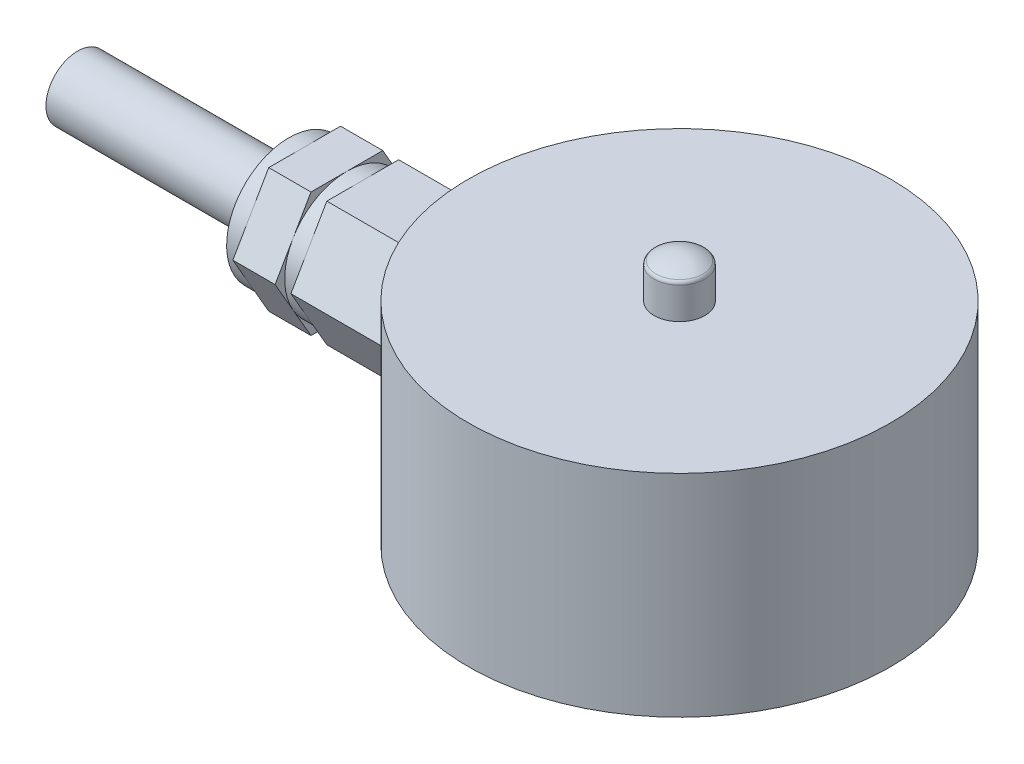
ISO-10303-21;
HEADER;
FILE_DESCRIPTION(('STEP AP214'),'2;1');
FILE_NAME('part.step','',(''),(''),'','','');
FILE_SCHEMA(('AUTOMOTIVE_DESIGN { 1 0 10303 214 1 1 1 1 }'));
ENDSEC;
DATA;
#1=APPLICATION_CONTEXT('core data for automotive mechanical design processes');
#2=APPLICATION_PROTOCOL_DEFINITION('international standard','automotive_design',2000,#1);
#3=PRODUCT_CONTEXT('',#1,'mechanical');
#4=PRODUCT('Part','Part','',(#3));
#5=PRODUCT_RELATED_PRODUCT_CATEGORY('part','',(#4));
#6=PRODUCT_DEFINITION_FORMATION('','',#4);
#7=PRODUCT_DEFINITION_CONTEXT('part definition',#1,'design');
#8=PRODUCT_DEFINITION('design','',#6,#7);
#9=PRODUCT_DEFINITION_SHAPE('','',#8);
#10=(LENGTH_UNIT() NAMED_UNIT(*) SI_UNIT(.MILLI.,.METRE.));
#11=(NAMED_UNIT(*) PLANE_ANGLE_UNIT() SI_UNIT($,.RADIAN.));
#12=(NAMED_UNIT(*) SI_UNIT($,.STERADIAN.) SOLID_ANGLE_UNIT());
#13=UNCERTAINTY_MEASURE_WITH_UNIT(LENGTH_MEASURE(1.E-05),#10,'distance_accuracy_value','');
#14=(GEOMETRIC_REPRESENTATION_CONTEXT(3) GLOBAL_UNCERTAINTY_ASSIGNED_CONTEXT((#13)) GLOBAL_UNIT_ASSIGNED_CONTEXT((#10,
#11,#12)) REPRESENTATION_CONTEXT('',''));
#15=CARTESIAN_POINT('',(0.,0.,0.));
#16=DIRECTION('',(0.,0.,1.));
#17=DIRECTION('',(1.,0.,0.));
#18=AXIS2_PLACEMENT_3D('',#15,#16,#17);
#19=CARTESIAN_POINT('',(-17.75,0.,0.));
#20=DIRECTION('',(-1.,0.,0.));
#21=DIRECTION('',(0.,0.,-1.));
#22=AXIS2_PLACEMENT_3D('',#19,#20,#21);
#23=PLANE('',#22);
#24=CARTESIAN_POINT('',(-17.75,4.5,0.));
#25=DIRECTION('',(1.,0.,0.));
#26=DIRECTION('',(0.,0.,-1.));
#27=AXIS2_PLACEMENT_3D('',#24,#25,#26);
#28=CIRCLE('',#27,2.94448637286709);
#29=CARTESIAN_POINT('',(-17.75,5.97224318643355,-2.55));
#30=VERTEX_POINT('',#29);
#31=CARTESIAN_POINT('',(-17.75,7.4444863728671,0.));
#32=VERTEX_POINT('',#31);
#33=EDGE_CURVE('E179',#30,#32,#28,.T.);
#34=ORIENTED_EDGE('',*,*,#33,.T.);
#35=DIRECTION('',(0.,0.,1.));
#36=VECTOR('',#35,1.);
#37=CARTESIAN_POINT('',(-17.75,7.4444863728671,-1.7));
#38=LINE('',#37,#36);
#39=CARTESIAN_POINT('',(-17.75,7.4444863728671,-1.7));
#40=VERTEX_POINT('',#39);
#41=EDGE_CURVE('E193',#40,#32,#38,.T.);
#42=ORIENTED_EDGE('',*,*,#41,.F.);
#43=DIRECTION('',(0.,0.866025403784439,0.5));
#44=VECTOR('',#43,1.);
#45=CARTESIAN_POINT('',(-17.75,4.5,-3.4));
#46=LINE('',#45,#44);
#47=EDGE_CURVE('E185',#30,#40,#46,.T.);
#48=ORIENTED_EDGE('',*,*,#47,.F.);
#49=EDGE_LOOP('',(#34,#42,#48));
#50=FACE_BOUND('',#49,.T.);
#51=ADVANCED_FACE('F17',(#50),#23,.T.);
#52=CARTESIAN_POINT('',(-17.75,5.97224318643356,2.55));
#53=VERTEX_POINT('',#52);
#54=EDGE_CURVE('E199',#32,#53,#28,.T.);
#55=ORIENTED_EDGE('',*,*,#54,.T.);
#56=DIRECTION('',(0.,-0.866025403784438,0.5));
#57=VECTOR('',#56,1.);
#58=CARTESIAN_POINT('',(-17.75,7.4444863728671,1.7));
#59=LINE('',#58,#57);
#60=CARTESIAN_POINT('',(-17.75,7.4444863728671,1.7));
#61=VERTEX_POINT('',#60);
#62=EDGE_CURVE('E980',#61,#53,#59,.T.);
#63=ORIENTED_EDGE('',*,*,#62,.F.);
#64=EDGE_CURVE('E188',#32,#61,#38,.T.);
#65=ORIENTED_EDGE('',*,*,#64,.F.);
#66=EDGE_LOOP('',(#55,#63,#65));
#67=FACE_BOUND('',#66,.T.);
#68=ADVANCED_FACE('F382',(#67),#23,.T.);
#69=CARTESIAN_POINT('',(-17.75,3.02775681356646,2.55));
#70=VERTEX_POINT('',#69);
#71=EDGE_CURVE('E209',#53,#70,#28,.T.);
#72=ORIENTED_EDGE('',*,*,#71,.T.);
#73=DIRECTION('',(0.,-0.866025403784439,-0.5));
#74=VECTOR('',#73,1.);
#75=CARTESIAN_POINT('',(-17.75,4.5,3.4));
#76=LINE('',#75,#74);
#77=CARTESIAN_POINT('',(-17.75,4.5,3.4));
#78=VERTEX_POINT('',#77);
#79=EDGE_CURVE('E234',#78,#70,#76,.T.);
#80=ORIENTED_EDGE('',*,*,#79,.F.);
#81=EDGE_CURVE('E977',#53,#78,#59,.T.);
#82=ORIENTED_EDGE('',*,*,#81,.F.);
#83=EDGE_LOOP('',(#72,#80,#82));
#84=FACE_BOUND('',#83,.T.);
#85=ADVANCED_FACE('F388',(#84),#23,.T.);
#86=CARTESIAN_POINT('',(-17.75,1.5555136271329,0.));
#87=VERTEX_POINT('',#86);
#88=EDGE_CURVE('E215',#70,#87,#28,.T.);
#89=ORIENTED_EDGE('',*,*,#88,.T.);
#90=DIRECTION('',(0.,0.,-1.));
#91=VECTOR('',#90,1.);
#92=CARTESIAN_POINT('',(-17.75,1.5555136271329,1.7));
#93=LINE('',#92,#91);
#94=CARTESIAN_POINT('',(-17.75,1.5555136271329,1.7));
#95=VERTEX_POINT('',#94);
#96=EDGE_CURVE('E227',#95,#87,#93,.T.);
#97=ORIENTED_EDGE('',*,*,#96,.F.);
#98=EDGE_CURVE('E982',#70,#95,#76,.T.);
#99=ORIENTED_EDGE('',*,*,#98,.F.);
#100=EDGE_LOOP('',(#89,#97,#99));
#101=FACE_BOUND('',#100,.T.);
#102=ADVANCED_FACE('F404',(#101),#23,.T.);
#103=CARTESIAN_POINT('',(-17.75,3.02775681356646,-2.55));
#104=VERTEX_POINT('',#103);
#105=EDGE_CURVE('E176',#87,#104,#28,.T.);
#106=ORIENTED_EDGE('',*,*,#105,.T.);
#107=DIRECTION('',(0.,0.866025403784439,-0.5));
#108=VECTOR('',#107,1.);
#109=CARTESIAN_POINT('',(-17.75,1.5555136271329,-1.7));
#110=LINE('',#109,#108);
#111=CARTESIAN_POINT('',(-17.75,1.5555136271329,-1.7));
#112=VERTEX_POINT('',#111);
#113=EDGE_CURVE('E223',#112,#104,#110,.T.);
#114=ORIENTED_EDGE('',*,*,#113,.F.);
#115=EDGE_CURVE('E40',#87,#112,#93,.T.);
#116=ORIENTED_EDGE('',*,*,#115,.F.);
#117=EDGE_LOOP('',(#106,#114,#116));
#118=FACE_BOUND('',#117,.T.);
#119=ADVANCED_FACE('F222',(#118),#23,.T.);
#120=CARTESIAN_POINT('',(-15.,0.,0.));
#121=DIRECTION('',(1.,0.,0.));
#122=DIRECTION('',(0.,0.,1.));
#123=AXIS2_PLACEMENT_3D('',#120,#121,#122);
#124=PLANE('',#123);
#125=CARTESIAN_POINT('',(-15.,4.5,0.));
#126=DIRECTION('',(1.,0.,0.));
#127=DIRECTION('',(0.,0.,-1.));
#128=AXIS2_PLACEMENT_3D('',#125,#126,#127);
#129=CIRCLE('',#128,2.94448637286709);
#130=CARTESIAN_POINT('',(-15.,5.97224318643355,-2.55));
#131=VERTEX_POINT('',#130);
#132=CARTESIAN_POINT('',(-15.,7.4444863728671,0.));
#133=VERTEX_POINT('',#132);
#134=EDGE_CURVE('E269',#131,#133,#129,.T.);
#135=ORIENTED_EDGE('',*,*,#134,.T.);
#136=DIRECTION('',(0.,0.,-1.));
#137=VECTOR('',#136,1.);
#138=CARTESIAN_POINT('',(-15.,7.4444863728671,1.7));
#139=LINE('',#138,#137);
#140=CARTESIAN_POINT('',(-15.,7.4444863728671,-1.7));
#141=VERTEX_POINT('',#140);
#142=EDGE_CURVE('E304',#133,#141,#139,.T.);
#143=ORIENTED_EDGE('',*,*,#142,.T.);
#144=DIRECTION('',(0.,-0.866025403784439,-0.5));
#145=VECTOR('',#144,1.);
#146=CARTESIAN_POINT('',(-15.,7.4444863728671,-1.7));
#147=LINE('',#146,#145);
#148=EDGE_CURVE('E308',#141,#131,#147,.T.);
#149=ORIENTED_EDGE('',*,*,#148,.T.);
#150=EDGE_LOOP('',(#135,#143,#149));
#151=FACE_BOUND('',#150,.T.);
#152=ADVANCED_FACE('F403',(#151),#124,.F.);
#153=CARTESIAN_POINT('',(-15.,5.97224318643355,2.55));
#154=VERTEX_POINT('',#153);
#155=EDGE_CURVE('E177',#133,#154,#129,.T.);
#156=ORIENTED_EDGE('',*,*,#155,.T.);
#157=DIRECTION('',(0.,0.866025403784439,-0.5));
#158=VECTOR('',#157,1.);
#159=CARTESIAN_POINT('',(-15.,4.5,3.4));
#160=LINE('',#159,#158);
#161=CARTESIAN_POINT('',(-15.,7.4444863728671,1.7));
#162=VERTEX_POINT('',#161);
#163=EDGE_CURVE('E301',#154,#162,#160,.T.);
#164=ORIENTED_EDGE('',*,*,#163,.T.);
#165=EDGE_CURVE('E305',#162,#133,#139,.T.);
#166=ORIENTED_EDGE('',*,*,#165,.T.);
#167=EDGE_LOOP('',(#156,#164,#166));
#168=FACE_BOUND('',#167,.T.);
#169=ADVANCED_FACE('F410',(#168),#124,.F.);
#170=CARTESIAN_POINT('',(-15.,3.02775681356646,2.55));
#171=VERTEX_POINT('',#170);
#172=EDGE_CURVE('E896',#154,#171,#129,.T.);
#173=ORIENTED_EDGE('',*,*,#172,.T.);
#174=DIRECTION('',(0.,0.866025403784439,0.5));
#175=VECTOR('',#174,1.);
#176=CARTESIAN_POINT('',(-15.,1.5555136271329,1.7));
#177=LINE('',#176,#175);
#178=CARTESIAN_POINT('',(-15.,4.5,3.4));
#179=VERTEX_POINT('',#178);
#180=EDGE_CURVE('E298',#171,#179,#177,.T.);
#181=ORIENTED_EDGE('',*,*,#180,.T.);
#182=EDGE_CURVE('E302',#179,#154,#160,.T.);
#183=ORIENTED_EDGE('',*,*,#182,.T.);
#184=EDGE_LOOP('',(#173,#181,#183));
#185=FACE_BOUND('',#184,.T.);
#186=ADVANCED_FACE('F457',(#185),#124,.F.);
#187=CARTESIAN_POINT('',(-15.,1.5555136271329,0.));
#188=VERTEX_POINT('',#187);
#189=EDGE_CURVE('E898',#171,#188,#129,.T.);
#190=ORIENTED_EDGE('',*,*,#189,.T.);
#191=DIRECTION('',(0.,0.,1.));
#192=VECTOR('',#191,1.);
#193=CARTESIAN_POINT('',(-15.,1.5555136271329,-1.7));
#194=LINE('',#193,#192);
#195=CARTESIAN_POINT('',(-15.,1.5555136271329,1.7));
#196=VERTEX_POINT('',#195);
#197=EDGE_CURVE('E273',#188,#196,#194,.T.);
#198=ORIENTED_EDGE('',*,*,#197,.T.);
#199=EDGE_CURVE('E299',#196,#171,#177,.T.);
#200=ORIENTED_EDGE('',*,*,#199,.T.);
#201=EDGE_LOOP('',(#190,#198,#200));
#202=FACE_BOUND('',#201,.T.);
#203=ADVANCED_FACE('F452',(#202),#124,.F.);
#204=CARTESIAN_POINT('',(-15.,3.02775681356646,-2.55));
#205=VERTEX_POINT('',#204);
#206=EDGE_CURVE('E901',#188,#205,#129,.T.);
#207=ORIENTED_EDGE('',*,*,#206,.T.);
#208=DIRECTION('',(0.,-0.866025403784439,0.5));
#209=VECTOR('',#208,1.);
#210=CARTESIAN_POINT('',(-15.,4.5,-3.4));
#211=LINE('',#210,#209);
#212=CARTESIAN_POINT('',(-15.,1.5555136271329,-1.7));
#213=VERTEX_POINT('',#212);
#214=EDGE_CURVE('E311',#205,#213,#211,.T.);
#215=ORIENTED_EDGE('',*,*,#214,.T.);
#216=EDGE_CURVE('E296',#213,#188,#194,.T.);
#217=ORIENTED_EDGE('',*,*,#216,.T.);
#218=EDGE_LOOP('',(#207,#215,#217));
#219=FACE_BOUND('',#218,.T.);
#220=ADVANCED_FACE('F448',(#219),#124,.F.);
#221=CARTESIAN_POINT('',(0.,10.,0.));
#222=DIRECTION('',(0.,-1.,0.));
#223=DIRECTION('',(0.,0.,1.));
#224=AXIS2_PLACEMENT_3D('',#221,#222,#223);
#225=CYLINDRICAL_SURFACE('',#224,10.);
#226=CARTESIAN_POINT('',(0.,0.,0.));
#227=DIRECTION('',(0.,-1.,0.));
#228=DIRECTION('',(0.,0.,-1.));
#229=AXIS2_PLACEMENT_3D('',#226,#227,#228);
#230=CIRCLE('',#229,10.);
#231=CARTESIAN_POINT('',(0.,0.,-10.));
#232=VERTEX_POINT('',#231);
#233=EDGE_CURVE('E348',#232,#232,#230,.T.);
#234=ORIENTED_EDGE('',*,*,#233,.F.);
#235=EDGE_LOOP('',(#234));
#236=FACE_BOUND('',#235,.T.);
#237=CARTESIAN_POINT('',(0.,10.,0.));
#238=DIRECTION('',(0.,-1.,0.));
#239=DIRECTION('',(0.,0.,-1.));
#240=AXIS2_PLACEMENT_3D('',#237,#238,#239);
#241=CIRCLE('',#240,10.);
#242=CARTESIAN_POINT('',(0.,10.,-10.));
#243=VERTEX_POINT('',#242);
#244=EDGE_CURVE('E349',#243,#243,#241,.T.);
#245=ORIENTED_EDGE('',*,*,#244,.T.);
#246=EDGE_LOOP('',(#245));
#247=FACE_BOUND('',#246,.T.);
#248=CARTESIAN_POINT('',(0.,-1.38897274573418,0.));
#249=DIRECTION('',(0.,-0.5,-0.866025403784439));
#250=DIRECTION('',(0.,-0.866025403784439,0.5));
#251=AXIS2_PLACEMENT_3D('',#248,#249,#250);
#252=ELLIPSE('',#251,20.,10.);
#253=CARTESIAN_POINT('',(-9.40425435640699,4.5,-3.4));
#254=VERTEX_POINT('',#253);
#255=CARTESIAN_POINT('',(-9.8544406233941,1.5555136271329,-1.7));
#256=VERTEX_POINT('',#255);
#257=EDGE_CURVE('E295',#254,#256,#252,.F.);
#258=ORIENTED_EDGE('',*,*,#257,.F.);
#259=CARTESIAN_POINT('',(0.,10.3889727457342,0.));
#260=DIRECTION('',(0.,0.5,-0.866025403784439));
#261=DIRECTION('',(0.,-0.866025403784439,-0.5));
#262=AXIS2_PLACEMENT_3D('',#259,#260,#261);
#263=ELLIPSE('',#262,20.,10.);
#264=CARTESIAN_POINT('',(-9.8544406233941,7.4444863728671,-1.7));
#265=VERTEX_POINT('',#264);
#266=EDGE_CURVE('E279',#265,#254,#263,.F.);
#267=ORIENTED_EDGE('',*,*,#266,.F.);
#268=CARTESIAN_POINT('',(0.,7.4444863728671,0.));
#269=DIRECTION('',(0.,1.,0.));
#270=DIRECTION('',(0.,0.,1.));
#271=AXIS2_PLACEMENT_3D('',#268,#269,#270);
#272=CIRCLE('',#271,10.);
#273=CARTESIAN_POINT('',(-9.8544406233941,7.4444863728671,1.7));
#274=VERTEX_POINT('',#273);
#275=EDGE_CURVE('E282',#274,#265,#272,.F.);
#276=ORIENTED_EDGE('',*,*,#275,.F.);
#277=CARTESIAN_POINT('',(0.,10.3889727457342,0.));
#278=DIRECTION('',(0.,0.5,0.866025403784439));
#279=DIRECTION('',(0.,-0.866025403784439,0.5));
#280=AXIS2_PLACEMENT_3D('',#277,#278,#279);
#281=ELLIPSE('',#280,20.,10.);
#282=CARTESIAN_POINT('',(-9.40425435640699,4.5,3.4));
#283=VERTEX_POINT('',#282);
#284=EDGE_CURVE('E286',#283,#274,#281,.F.);
#285=ORIENTED_EDGE('',*,*,#284,.F.);
#286=CARTESIAN_POINT('',(0.,-1.38897274573419,0.));
#287=DIRECTION('',(0.,-0.5,0.866025403784439));
#288=DIRECTION('',(0.,-0.866025403784439,-0.5));
#289=AXIS2_PLACEMENT_3D('',#286,#287,#288);
#290=ELLIPSE('',#289,20.,10.);
#291=CARTESIAN_POINT('',(-9.8544406233941,1.5555136271329,1.7));
#292=VERTEX_POINT('',#291);
#293=EDGE_CURVE('E289',#292,#283,#290,.F.);
#294=ORIENTED_EDGE('',*,*,#293,.F.);
#295=CARTESIAN_POINT('',(0.,1.5555136271329,0.));
#296=DIRECTION('',(0.,-1.,0.));
#297=DIRECTION('',(0.,0.,-1.));
#298=AXIS2_PLACEMENT_3D('',#295,#296,#297);
#299=CIRCLE('',#298,10.);
#300=EDGE_CURVE('E292',#256,#292,#299,.F.);
#301=ORIENTED_EDGE('',*,*,#300,.F.);
#302=EDGE_LOOP('',(#258,#267,#276,#285,#294,#301));
#303=FACE_BOUND('',#302,.T.);
#304=ADVANCED_FACE('F462',(#236,#247,#303),#225,.T.);
#305=CARTESIAN_POINT('',(0.,10.,0.));
#306=DIRECTION('',(0.,1.,0.));
#307=DIRECTION('',(0.,0.,-1.));
#308=AXIS2_PLACEMENT_3D('',#305,#306,#307);
#309=PLANE('',#308);
#310=CARTESIAN_POINT('',(0.,10.,0.));
#311=DIRECTION('',(0.,-1.,0.));
#312=DIRECTION('',(0.,0.,-1.));
#313=AXIS2_PLACEMENT_3D('',#310,#311,#312);
#314=CIRCLE('',#313,1.2);
#315=CARTESIAN_POINT('',(0.,10.,-1.2));
#316=VERTEX_POINT('',#315);
#317=EDGE_CURVE('E345',#316,#316,#314,.T.);
#318=ORIENTED_EDGE('',*,*,#317,.T.);
#319=EDGE_LOOP('',(#318));
#320=FACE_BOUND('',#319,.T.);
#321=ORIENTED_EDGE('',*,*,#244,.F.);
#322=EDGE_LOOP('',(#321));
#323=FACE_BOUND('',#322,.T.);
#324=ADVANCED_FACE('F467',(#320,#323),#309,.T.);
#325=CARTESIAN_POINT('',(0.,0.,0.));
#326=DIRECTION('',(0.,1.,0.));
#327=DIRECTION('',(0.,0.,-1.));
#328=AXIS2_PLACEMENT_3D('',#325,#326,#327);
#329=PLANE('',#328);
#330=CARTESIAN_POINT('',(0.,0.,0.));
#331=DIRECTION('',(0.,-1.,0.));
#332=DIRECTION('',(0.,0.,-1.));
#333=AXIS2_PLACEMENT_3D('',#330,#331,#332);
#334=CIRCLE('',#333,5.7);
#335=CARTESIAN_POINT('',(0.,0.,-5.7));
#336=VERTEX_POINT('',#335);
#337=EDGE_CURVE('E11',#336,#336,#334,.T.);
#338=ORIENTED_EDGE('',*,*,#337,.F.);
#339=EDGE_LOOP('',(#338));
#340=FACE_BOUND('',#339,.T.);
#341=CARTESIAN_POINT('',(-3.74999999999994,0.,-6.49519052838333));
#342=DIRECTION('',(0.,1.,0.));
#343=DIRECTION('',(0.,0.,1.));
#344=AXIS2_PLACEMENT_3D('',#341,#342,#343);
#345=CIRCLE('',#344,1.25);
#346=CARTESIAN_POINT('',(-3.74999999999994,0.,-5.24519052838333));
#347=VERTEX_POINT('',#346);
#348=EDGE_CURVE('E327',#347,#347,#345,.T.);
#349=ORIENTED_EDGE('',*,*,#348,.T.);
#350=EDGE_LOOP('',(#349));
#351=FACE_BOUND('',#350,.T.);
#352=CARTESIAN_POINT('',(-3.75,0.,6.49519052838327));
#353=DIRECTION('',(0.,1.,0.));
#354=DIRECTION('',(0.,0.,1.));
#355=AXIS2_PLACEMENT_3D('',#352,#353,#354);
#356=CIRCLE('',#355,1.25);
#357=CARTESIAN_POINT('',(-3.75,0.,7.74519052838327));
#358=VERTEX_POINT('',#357);
#359=EDGE_CURVE('E333',#358,#358,#356,.T.);
#360=ORIENTED_EDGE('',*,*,#359,.T.);
#361=EDGE_LOOP('',(#360));
#362=FACE_BOUND('',#361,.T.);
#363=CARTESIAN_POINT('',(7.5,0.,0.));
#364=DIRECTION('',(0.,1.,0.));
#365=DIRECTION('',(0.,0.,1.));
#366=AXIS2_PLACEMENT_3D('',#363,#364,#365);
#367=CIRCLE('',#366,1.25);
#368=CARTESIAN_POINT('',(7.5,0.,1.25));
#369=VERTEX_POINT('',#368);
#370=EDGE_CURVE('E339',#369,#369,#367,.T.);
#371=ORIENTED_EDGE('',*,*,#370,.T.);
#372=EDGE_LOOP('',(#371));
#373=FACE_BOUND('',#372,.T.);
#374=ORIENTED_EDGE('',*,*,#233,.T.);
#375=EDGE_LOOP('',(#374));
#376=FACE_BOUND('',#375,.T.);
#377=ADVANCED_FACE('F724',(#340,#351,#362,#373,#376),#329,.F.);
#378=CARTESIAN_POINT('',(0.,11.6,0.));
#379=DIRECTION('',(0.,-1.,0.));
#380=DIRECTION('',(0.,0.,1.));
#381=AXIS2_PLACEMENT_3D('',#378,#379,#380);
#382=CYLINDRICAL_SURFACE('',#381,1.2);
#383=CARTESIAN_POINT('',(0.,11.4966629547096,0.));
#384=DIRECTION('',(0.,1.,0.));
#385=DIRECTION('',(0.,0.,1.));
#386=AXIS2_PLACEMENT_3D('',#383,#384,#385);
#387=CIRCLE('',#386,1.2);
#388=CARTESIAN_POINT('',(0.,11.4966629547096,1.2));
#389=VERTEX_POINT('',#388);
#390=EDGE_CURVE('E357',#389,#389,#387,.T.);
#391=ORIENTED_EDGE('',*,*,#390,.F.);
#392=EDGE_LOOP('',(#391));
#393=FACE_BOUND('',#392,.T.);
#394=ORIENTED_EDGE('',*,*,#317,.F.);
#395=EDGE_LOOP('',(#394));
#396=FACE_BOUND('',#395,.T.);
#397=ADVANCED_FACE('F716',(#393,#396),#382,.T.);
#398=CARTESIAN_POINT('',(0.,10.,0.));
#399=DIRECTION('',(0.,0.,-1.));
#400=DIRECTION('',(1.,0.,0.));
#401=AXIS2_PLACEMENT_3D('',#398,#399,#400);
#402=SPHERICAL_SURFACE('',#401,2.);
#403=CARTESIAN_POINT('',(0.,10.,0.));
#404=DIRECTION('',(0.,1.,0.));
#405=DIRECTION('',(0.,0.,1.));
#406=AXIS2_PLACEMENT_3D('',#403,#404,#405);
#407=SPHERICAL_SURFACE('',#406,2.);
#408=CARTESIAN_POINT('',(0.,11.6629588385662,0.));
#409=DIRECTION('',(0.,1.,0.));
#410=DIRECTION('',(0.,0.,1.));
#411=AXIS2_PLACEMENT_3D('',#408,#409,#410);
#412=CIRCLE('',#411,1.11111111111111);
#413=CARTESIAN_POINT('',(0.,11.6629588385662,1.11111111111111));
#414=VERTEX_POINT('',#413);
#415=EDGE_CURVE('E352',#414,#414,#412,.F.);
#416=ORIENTED_EDGE('',*,*,#415,.F.);
#417=EDGE_LOOP('',(#416));
#418=FACE_BOUND('',#417,.T.);
#419=ADVANCED_FACE('F709',(#418),#407,.T.);
#420=CARTESIAN_POINT('',(0.,11.4966629547096,0.));
#421=DIRECTION('',(0.,-1.,0.));
#422=DIRECTION('',(0.,0.,1.));
#423=AXIS2_PLACEMENT_3D('',#420,#421,#422);
#424=TOROIDAL_SURFACE('',#423,1.,0.2);
#425=ORIENTED_EDGE('',*,*,#390,.T.);
#426=EDGE_LOOP('',(#425));
#427=FACE_BOUND('',#426,.T.);
#428=ORIENTED_EDGE('',*,*,#415,.T.);
#429=EDGE_LOOP('',(#428));
#430=FACE_BOUND('',#429,.T.);
#431=ADVANCED_FACE('F701',(#427,#430),#424,.T.);
#432=CARTESIAN_POINT('',(7.5,7.5,0.));
#433=DIRECTION('',(0.,-1.,0.));
#434=DIRECTION('',(0.,0.,1.));
#435=AXIS2_PLACEMENT_3D('',#432,#433,#434);
#436=CONICAL_SURFACE('',#435,1.25,1.02974425867665);
#437=CARTESIAN_POINT('',(7.5,8.25107577378445,0.));
#438=VERTEX_POINT('',#437);
#439=VERTEX_LOOP('',#438);
#440=FACE_BOUND('',#439,.T.);
#441=CARTESIAN_POINT('',(7.5,7.5,0.));
#442=DIRECTION('',(0.,1.,0.));
#443=DIRECTION('',(0.,0.,1.));
#444=AXIS2_PLACEMENT_3D('',#441,#442,#443);
#445=CIRCLE('',#444,1.25);
#446=CARTESIAN_POINT('',(7.5,7.5,1.25));
#447=VERTEX_POINT('',#446);
#448=EDGE_CURVE('E342',#447,#447,#445,.T.);
#449=ORIENTED_EDGE('',*,*,#448,.F.);
#450=EDGE_LOOP('',(#449));
#451=FACE_BOUND('',#450,.T.);
#452=ADVANCED_FACE('F691',(#440,#451),#436,.F.);
#453=CARTESIAN_POINT('',(7.5,0.,0.));
#454=DIRECTION('',(0.,-1.,0.));
#455=DIRECTION('',(0.,0.,1.));
#456=AXIS2_PLACEMENT_3D('',#453,#454,#455);
#457=CYLINDRICAL_SURFACE('',#456,1.25);
#458=ORIENTED_EDGE('',*,*,#448,.T.);
#459=EDGE_LOOP('',(#458));
#460=FACE_BOUND('',#459,.T.);
#461=ORIENTED_EDGE('',*,*,#370,.F.);
#462=EDGE_LOOP('',(#461));
#463=FACE_BOUND('',#462,.T.);
#464=ADVANCED_FACE('F683',(#460,#463),#457,.F.);
#465=CARTESIAN_POINT('',(-3.75,7.5,6.49519052838327));
#466=DIRECTION('',(0.,-1.,0.));
#467=DIRECTION('',(0.,0.,1.));
#468=AXIS2_PLACEMENT_3D('',#465,#466,#467);
#469=CONICAL_SURFACE('',#468,1.25,1.02974425867665);
#470=CARTESIAN_POINT('',(-3.75,8.25107577378445,6.49519052838327));
#471=VERTEX_POINT('',#470);
#472=VERTEX_LOOP('',#471);
#473=FACE_BOUND('',#472,.T.);
#474=CARTESIAN_POINT('',(-3.75,7.5,6.49519052838327));
#475=DIRECTION('',(0.,1.,0.));
#476=DIRECTION('',(0.,0.,1.));
#477=AXIS2_PLACEMENT_3D('',#474,#475,#476);
#478=CIRCLE('',#477,1.25);
#479=CARTESIAN_POINT('',(-3.75,7.5,7.74519052838327));
#480=VERTEX_POINT('',#479);
#481=EDGE_CURVE('E336',#480,#480,#478,.T.);
#482=ORIENTED_EDGE('',*,*,#481,.F.);
#483=EDGE_LOOP('',(#482));
#484=FACE_BOUND('',#483,.T.);
#485=ADVANCED_FACE('F673',(#473,#484),#469,.F.);
#486=CARTESIAN_POINT('',(-3.75,0.,6.49519052838327));
#487=DIRECTION('',(0.,-1.,0.));
#488=DIRECTION('',(0.,0.,1.));
#489=AXIS2_PLACEMENT_3D('',#486,#487,#488);
#490=CYLINDRICAL_SURFACE('',#489,1.25);
#491=ORIENTED_EDGE('',*,*,#481,.T.);
#492=EDGE_LOOP('',(#491));
#493=FACE_BOUND('',#492,.T.);
#494=ORIENTED_EDGE('',*,*,#359,.F.);
#495=EDGE_LOOP('',(#494));
#496=FACE_BOUND('',#495,.T.);
#497=ADVANCED_FACE('F664',(#493,#496),#490,.F.);
#498=CARTESIAN_POINT('',(-3.74999999999994,7.5,-6.49519052838333));
#499=DIRECTION('',(0.,-1.,0.));
#500=DIRECTION('',(0.,0.,1.));
#501=AXIS2_PLACEMENT_3D('',#498,#499,#500);
#502=CONICAL_SURFACE('',#501,1.25,1.02974425867665);
#503=CARTESIAN_POINT('',(-3.74999999999994,8.25107577378445,-6.49519052838333));
#504=VERTEX_POINT('',#503);
#505=VERTEX_LOOP('',#504);
#506=FACE_BOUND('',#505,.T.);
#507=CARTESIAN_POINT('',(-3.74999999999994,7.5,-6.49519052838333));
#508=DIRECTION('',(0.,1.,0.));
#509=DIRECTION('',(0.,0.,1.));
#510=AXIS2_PLACEMENT_3D('',#507,#508,#509);
#511=CIRCLE('',#510,1.25);
#512=CARTESIAN_POINT('',(-3.74999999999994,7.5,-5.24519052838333));
#513=VERTEX_POINT('',#512);
#514=EDGE_CURVE('E330',#513,#513,#511,.T.);
#515=ORIENTED_EDGE('',*,*,#514,.F.);
#516=EDGE_LOOP('',(#515));
#517=FACE_BOUND('',#516,.T.);
#518=ADVANCED_FACE('F652',(#506,#517),#502,.F.);
#519=CARTESIAN_POINT('',(-3.74999999999994,0.,-6.49519052838333));
#520=DIRECTION('',(0.,-1.,0.));
#521=DIRECTION('',(0.,0.,1.));
#522=AXIS2_PLACEMENT_3D('',#519,#520,#521);
#523=CYLINDRICAL_SURFACE('',#522,1.25);
#524=ORIENTED_EDGE('',*,*,#514,.T.);
#525=EDGE_LOOP('',(#524));
#526=FACE_BOUND('',#525,.T.);
#527=ORIENTED_EDGE('',*,*,#348,.F.);
#528=EDGE_LOOP('',(#527));
#529=FACE_BOUND('',#528,.T.);
#530=ADVANCED_FACE('F446',(#526,#529),#523,.F.);
#531=EDGE_CURVE('E278',#205,#131,#129,.T.);
#532=ORIENTED_EDGE('',*,*,#531,.T.);
#533=CARTESIAN_POINT('',(-15.,4.5,-3.4));
#534=VERTEX_POINT('',#533);
#535=EDGE_CURVE('E307',#131,#534,#147,.T.);
#536=ORIENTED_EDGE('',*,*,#535,.T.);
#537=EDGE_CURVE('E312',#534,#205,#211,.T.);
#538=ORIENTED_EDGE('',*,*,#537,.T.);
#539=EDGE_LOOP('',(#532,#536,#538));
#540=FACE_BOUND('',#539,.T.);
#541=ADVANCED_FACE('F413',(#540),#124,.F.);
#542=CARTESIAN_POINT('',(10.001,4.5,-3.4));
#543=DIRECTION('',(0.,0.5,0.866025403784439));
#544=DIRECTION('',(0.,0.866025403784439,-0.5));
#545=AXIS2_PLACEMENT_3D('',#542,#543,#544);
#546=PLANE('',#545);
#547=ORIENTED_EDGE('',*,*,#257,.T.);
#548=DIRECTION('',(-1.,0.,0.));
#549=VECTOR('',#548,1.);
#550=CARTESIAN_POINT('',(10.001,1.5555136271329,-1.7));
#551=LINE('',#550,#549);
#552=EDGE_CURVE('E314',#256,#213,#551,.T.);
#553=ORIENTED_EDGE('',*,*,#552,.T.);
#554=ORIENTED_EDGE('',*,*,#214,.F.);
#555=ORIENTED_EDGE('',*,*,#537,.F.);
#556=DIRECTION('',(-1.,0.,0.));
#557=VECTOR('',#556,1.);
#558=CARTESIAN_POINT('',(10.001,4.5,-3.4));
#559=LINE('',#558,#557);
#560=EDGE_CURVE('E316',#254,#534,#559,.T.);
#561=ORIENTED_EDGE('',*,*,#560,.F.);
#562=EDGE_LOOP('',(#547,#553,#554,#555,#561));
#563=FACE_BOUND('',#562,.T.);
#564=ADVANCED_FACE('F445',(#563),#546,.F.);
#565=CARTESIAN_POINT('',(10.001,7.4444863728671,-1.7));
#566=DIRECTION('',(0.,-0.5,0.866025403784439));
#567=DIRECTION('',(0.,0.866025403784439,0.5));
#568=AXIS2_PLACEMENT_3D('',#565,#566,#567);
#569=PLANE('',#568);
#570=ORIENTED_EDGE('',*,*,#266,.T.);
#571=ORIENTED_EDGE('',*,*,#560,.T.);
#572=ORIENTED_EDGE('',*,*,#535,.F.);
#573=ORIENTED_EDGE('',*,*,#148,.F.);
#574=DIRECTION('',(-1.,0.,0.));
#575=VECTOR('',#574,1.);
#576=CARTESIAN_POINT('',(10.001,7.4444863728671,-1.7));
#577=LINE('',#576,#575);
#578=EDGE_CURVE('E318',#265,#141,#577,.T.);
#579=ORIENTED_EDGE('',*,*,#578,.F.);
#580=EDGE_LOOP('',(#570,#571,#572,#573,#579));
#581=FACE_BOUND('',#580,.T.);
#582=ADVANCED_FACE('F631',(#581),#569,.F.);
#583=CARTESIAN_POINT('',(10.001,7.4444863728671,1.7));
#584=DIRECTION('',(0.,-1.,0.));
#585=DIRECTION('',(0.,0.,1.));
#586=AXIS2_PLACEMENT_3D('',#583,#584,#585);
#587=PLANE('',#586);
#588=ORIENTED_EDGE('',*,*,#275,.T.);
#589=ORIENTED_EDGE('',*,*,#578,.T.);
#590=ORIENTED_EDGE('',*,*,#142,.F.);
#591=ORIENTED_EDGE('',*,*,#165,.F.);
#592=DIRECTION('',(-1.,0.,0.));
#593=VECTOR('',#592,1.);
#594=CARTESIAN_POINT('',(10.001,7.4444863728671,1.7));
#595=LINE('',#594,#593);
#596=EDGE_CURVE('E320',#274,#162,#595,.T.);
#597=ORIENTED_EDGE('',*,*,#596,.F.);
#598=EDGE_LOOP('',(#588,#589,#590,#591,#597));
#599=FACE_BOUND('',#598,.T.);
#600=ADVANCED_FACE('F623',(#599),#587,.F.);
#601=CARTESIAN_POINT('',(10.001,4.5,3.4));
#602=DIRECTION('',(0.,-0.5,-0.866025403784439));
#603=DIRECTION('',(0.,-0.866025403784439,0.5));
#604=AXIS2_PLACEMENT_3D('',#601,#602,#603);
#605=PLANE('',#604);
#606=ORIENTED_EDGE('',*,*,#284,.T.);
#607=ORIENTED_EDGE('',*,*,#596,.T.);
#608=ORIENTED_EDGE('',*,*,#163,.F.);
#609=ORIENTED_EDGE('',*,*,#182,.F.);
#610=DIRECTION('',(-1.,0.,0.));
#611=VECTOR('',#610,1.);
#612=CARTESIAN_POINT('',(10.001,4.5,3.4));
#613=LINE('',#612,#611);
#614=EDGE_CURVE('E322',#283,#179,#613,.T.);
#615=ORIENTED_EDGE('',*,*,#614,.F.);
#616=EDGE_LOOP('',(#606,#607,#608,#609,#615));
#617=FACE_BOUND('',#616,.T.);
#618=ADVANCED_FACE('F615',(#617),#605,.F.);
#619=CARTESIAN_POINT('',(10.001,1.5555136271329,1.7));
#620=DIRECTION('',(0.,0.5,-0.866025403784439));
#621=DIRECTION('',(0.,-0.866025403784439,-0.5));
#622=AXIS2_PLACEMENT_3D('',#619,#620,#621);
#623=PLANE('',#622);
#624=ORIENTED_EDGE('',*,*,#293,.T.);
#625=ORIENTED_EDGE('',*,*,#614,.T.);
#626=ORIENTED_EDGE('',*,*,#180,.F.);
#627=ORIENTED_EDGE('',*,*,#199,.F.);
#628=DIRECTION('',(-1.,0.,0.));
#629=VECTOR('',#628,1.);
#630=CARTESIAN_POINT('',(10.001,1.5555136271329,1.7));
#631=LINE('',#630,#629);
#632=EDGE_CURVE('E283',#292,#196,#631,.T.);
#633=ORIENTED_EDGE('',*,*,#632,.F.);
#634=EDGE_LOOP('',(#624,#625,#626,#627,#633));
#635=FACE_BOUND('',#634,.T.);
#636=ADVANCED_FACE('F607',(#635),#623,.F.);
#637=CARTESIAN_POINT('',(10.001,1.5555136271329,-1.7));
#638=DIRECTION('',(0.,1.,0.));
#639=DIRECTION('',(0.,0.,-1.));
#640=AXIS2_PLACEMENT_3D('',#637,#638,#639);
#641=PLANE('',#640);
#642=ORIENTED_EDGE('',*,*,#300,.T.);
#643=ORIENTED_EDGE('',*,*,#632,.T.);
#644=ORIENTED_EDGE('',*,*,#197,.F.);
#645=ORIENTED_EDGE('',*,*,#216,.F.);
#646=ORIENTED_EDGE('',*,*,#552,.F.);
#647=EDGE_LOOP('',(#642,#643,#644,#645,#646));
#648=FACE_BOUND('',#647,.T.);
#649=ADVANCED_FACE('F599',(#648),#641,.F.);
#650=CARTESIAN_POINT('',(-15.75,4.5,0.));
#651=DIRECTION('',(1.,0.,0.));
#652=DIRECTION('',(0.,0.,1.));
#653=AXIS2_PLACEMENT_3D('',#650,#651,#652);
#654=CYLINDRICAL_SURFACE('',#653,2.94448637286709);
#655=CARTESIAN_POINT('',(-15.75,4.5,0.));
#656=DIRECTION('',(1.,0.,0.));
#657=DIRECTION('',(0.,0.,-1.));
#658=AXIS2_PLACEMENT_3D('',#655,#656,#657);
#659=CIRCLE('',#658,2.94448637286709);
#660=CARTESIAN_POINT('',(-15.75,5.97224318643355,-2.55));
#661=VERTEX_POINT('',#660);
#662=CARTESIAN_POINT('',(-15.75,7.4444863728671,0.));
#663=VERTEX_POINT('',#662);
#664=EDGE_CURVE('E270',#661,#663,#659,.T.);
#665=ORIENTED_EDGE('',*,*,#664,.T.);
#666=CARTESIAN_POINT('',(-15.75,5.97224318643355,2.55));
#667=VERTEX_POINT('',#666);
#668=EDGE_CURVE('E274',#663,#667,#659,.T.);
#669=ORIENTED_EDGE('',*,*,#668,.T.);
#670=CARTESIAN_POINT('',(-15.75,3.02775681356646,2.55));
#671=VERTEX_POINT('',#670);
#672=EDGE_CURVE('E967',#667,#671,#659,.T.);
#673=ORIENTED_EDGE('',*,*,#672,.T.);
#674=CARTESIAN_POINT('',(-15.75,1.5555136271329,0.));
#675=VERTEX_POINT('',#674);
#676=EDGE_CURVE('E968',#671,#675,#659,.T.);
#677=ORIENTED_EDGE('',*,*,#676,.T.);
#678=CARTESIAN_POINT('',(-15.75,3.02775681356645,-2.55));
#679=VERTEX_POINT('',#678);
#680=EDGE_CURVE('E970',#675,#679,#659,.T.);
#681=ORIENTED_EDGE('',*,*,#680,.T.);
#682=EDGE_CURVE('E275',#679,#661,#659,.T.);
#683=ORIENTED_EDGE('',*,*,#682,.T.);
#684=EDGE_LOOP('',(#665,#669,#673,#677,#681,#683));
#685=FACE_BOUND('',#684,.T.);
#686=ORIENTED_EDGE('',*,*,#134,.F.);
#687=ORIENTED_EDGE('',*,*,#531,.F.);
#688=ORIENTED_EDGE('',*,*,#206,.F.);
#689=ORIENTED_EDGE('',*,*,#189,.F.);
#690=ORIENTED_EDGE('',*,*,#172,.F.);
#691=ORIENTED_EDGE('',*,*,#155,.F.);
#692=EDGE_LOOP('',(#686,#687,#688,#689,#690,#691));
#693=FACE_BOUND('',#692,.T.);
#694=ADVANCED_FACE('F592',(#685,#693),#654,.T.);
#695=CARTESIAN_POINT('',(-15.75,0.,0.));
#696=DIRECTION('',(-1.,0.,0.));
#697=DIRECTION('',(0.,0.,-1.));
#698=AXIS2_PLACEMENT_3D('',#695,#696,#697);
#699=PLANE('',#698);
#700=DIRECTION('',(0.,0.866025403784439,0.5));
#701=VECTOR('',#700,1.);
#702=CARTESIAN_POINT('',(-15.75,4.5,-3.4));
#703=LINE('',#702,#701);
#704=CARTESIAN_POINT('',(-15.75,7.4444863728671,-1.7));
#705=VERTEX_POINT('',#704);
#706=EDGE_CURVE('E203',#661,#705,#703,.T.);
#707=ORIENTED_EDGE('',*,*,#706,.T.);
#708=DIRECTION('',(0.,0.,1.));
#709=VECTOR('',#708,1.);
#710=CARTESIAN_POINT('',(-15.75,7.4444863728671,-1.7));
#711=LINE('',#710,#709);
#712=EDGE_CURVE('E241',#705,#663,#711,.T.);
#713=ORIENTED_EDGE('',*,*,#712,.T.);
#714=ORIENTED_EDGE('',*,*,#664,.F.);
#715=EDGE_LOOP('',(#707,#713,#714));
#716=FACE_BOUND('',#715,.T.);
#717=ADVANCED_FACE('F559',(#716),#699,.F.);
#718=CARTESIAN_POINT('',(-15.75,7.4444863728671,1.7));
#719=VERTEX_POINT('',#718);
#720=EDGE_CURVE('E240',#663,#719,#711,.T.);
#721=ORIENTED_EDGE('',*,*,#720,.T.);
#722=DIRECTION('',(0.,-0.866025403784438,0.5));
#723=VECTOR('',#722,1.);
#724=CARTESIAN_POINT('',(-15.75,7.4444863728671,1.7));
#725=LINE('',#724,#723);
#726=EDGE_CURVE('E245',#719,#667,#725,.T.);
#727=ORIENTED_EDGE('',*,*,#726,.T.);
#728=ORIENTED_EDGE('',*,*,#668,.F.);
#729=EDGE_LOOP('',(#721,#727,#728));
#730=FACE_BOUND('',#729,.T.);
#731=ADVANCED_FACE('F579',(#730),#699,.F.);
#732=CARTESIAN_POINT('',(-15.75,4.5,3.4));
#733=VERTEX_POINT('',#732);
#734=EDGE_CURVE('E244',#667,#733,#725,.T.);
#735=ORIENTED_EDGE('',*,*,#734,.T.);
#736=DIRECTION('',(0.,-0.866025403784439,-0.5));
#737=VECTOR('',#736,1.);
#738=CARTESIAN_POINT('',(-15.75,4.5,3.4));
#739=LINE('',#738,#737);
#740=EDGE_CURVE('E249',#733,#671,#739,.T.);
#741=ORIENTED_EDGE('',*,*,#740,.T.);
#742=ORIENTED_EDGE('',*,*,#672,.F.);
#743=EDGE_LOOP('',(#735,#741,#742));
#744=FACE_BOUND('',#743,.T.);
#745=ADVANCED_FACE('F572',(#744),#699,.F.);
#746=CARTESIAN_POINT('',(-15.75,1.5555136271329,1.7));
#747=VERTEX_POINT('',#746);
#748=EDGE_CURVE('E248',#671,#747,#739,.T.);
#749=ORIENTED_EDGE('',*,*,#748,.T.);
#750=DIRECTION('',(0.,0.,-1.));
#751=VECTOR('',#750,1.);
#752=CARTESIAN_POINT('',(-15.75,1.5555136271329,1.7));
#753=LINE('',#752,#751);
#754=EDGE_CURVE('E253',#747,#675,#753,.T.);
#755=ORIENTED_EDGE('',*,*,#754,.T.);
#756=ORIENTED_EDGE('',*,*,#676,.F.);
#757=EDGE_LOOP('',(#749,#755,#756));
#758=FACE_BOUND('',#757,.T.);
#759=ADVANCED_FACE('F565',(#758),#699,.F.);
#760=CARTESIAN_POINT('',(-15.75,1.5555136271329,-1.7));
#761=VERTEX_POINT('',#760);
#762=EDGE_CURVE('E252',#675,#761,#753,.T.);
#763=ORIENTED_EDGE('',*,*,#762,.T.);
#764=DIRECTION('',(0.,0.866025403784439,-0.5));
#765=VECTOR('',#764,1.);
#766=CARTESIAN_POINT('',(-15.75,1.5555136271329,-1.7));
#767=LINE('',#766,#765);
#768=EDGE_CURVE('E194',#761,#679,#767,.T.);
#769=ORIENTED_EDGE('',*,*,#768,.T.);
#770=ORIENTED_EDGE('',*,*,#680,.F.);
#771=EDGE_LOOP('',(#763,#769,#770));
#772=FACE_BOUND('',#771,.T.);
#773=ADVANCED_FACE('F557',(#772),#699,.F.);
#774=CARTESIAN_POINT('',(-15.75,4.5,-3.4));
#775=VERTEX_POINT('',#774);
#776=EDGE_CURVE('E256',#679,#775,#767,.T.);
#777=ORIENTED_EDGE('',*,*,#776,.T.);
#778=EDGE_CURVE('E238',#775,#661,#703,.T.);
#779=ORIENTED_EDGE('',*,*,#778,.T.);
#780=ORIENTED_EDGE('',*,*,#682,.F.);
#781=EDGE_LOOP('',(#777,#779,#780));
#782=FACE_BOUND('',#781,.T.);
#783=ADVANCED_FACE('F550',(#782),#699,.F.);
#784=CARTESIAN_POINT('',(-17.75,4.5,-3.4));
#785=DIRECTION('',(0.,-0.5,0.866025403784439));
#786=DIRECTION('',(0.,0.866025403784439,0.5));
#787=AXIS2_PLACEMENT_3D('',#784,#785,#786);
#788=PLANE('',#787);
#789=ORIENTED_EDGE('',*,*,#778,.F.);
#790=DIRECTION('',(1.,0.,0.));
#791=VECTOR('',#790,1.);
#792=CARTESIAN_POINT('',(-17.75,4.5,-3.4));
#793=LINE('',#792,#791);
#794=CARTESIAN_POINT('',(-17.75,4.5,-3.4));
#795=VERTEX_POINT('',#794);
#796=EDGE_CURVE('E187',#795,#775,#793,.T.);
#797=ORIENTED_EDGE('',*,*,#796,.F.);
#798=EDGE_CURVE('E172',#795,#30,#46,.T.);
#799=ORIENTED_EDGE('',*,*,#798,.T.);
#800=ORIENTED_EDGE('',*,*,#47,.T.);
#801=DIRECTION('',(1.,0.,0.));
#802=VECTOR('',#801,1.);
#803=CARTESIAN_POINT('',(-17.75,7.4444863728671,-1.7));
#804=LINE('',#803,#802);
#805=EDGE_CURVE('E267',#40,#705,#804,.T.);
#806=ORIENTED_EDGE('',*,*,#805,.T.);
#807=ORIENTED_EDGE('',*,*,#706,.F.);
#808=EDGE_LOOP('',(#789,#797,#799,#800,#806,#807));
#809=FACE_BOUND('',#808,.T.);
#810=ADVANCED_FACE('F184',(#809),#788,.F.);
#811=CARTESIAN_POINT('',(-17.75,7.4444863728671,-1.7));
#812=DIRECTION('',(0.,-1.,0.));
#813=DIRECTION('',(0.,0.,1.));
#814=AXIS2_PLACEMENT_3D('',#811,#812,#813);
#815=PLANE('',#814);
#816=ORIENTED_EDGE('',*,*,#712,.F.);
#817=ORIENTED_EDGE('',*,*,#805,.F.);
#818=ORIENTED_EDGE('',*,*,#41,.T.);
#819=ORIENTED_EDGE('',*,*,#64,.T.);
#820=DIRECTION('',(1.,0.,0.));
#821=VECTOR('',#820,1.);
#822=CARTESIAN_POINT('',(-17.75,7.4444863728671,1.7));
#823=LINE('',#822,#821);
#824=EDGE_CURVE('E265',#61,#719,#823,.T.);
#825=ORIENTED_EDGE('',*,*,#824,.T.);
#826=ORIENTED_EDGE('',*,*,#720,.F.);
#827=EDGE_LOOP('',(#816,#817,#818,#819,#825,#826));
#828=FACE_BOUND('',#827,.T.);
#829=ADVANCED_FACE('F535',(#828),#815,.F.);
#830=CARTESIAN_POINT('',(-17.75,7.4444863728671,1.7));
#831=DIRECTION('',(0.,-0.5,-0.866025403784438));
#832=DIRECTION('',(0.,-0.866025403784438,0.5));
#833=AXIS2_PLACEMENT_3D('',#830,#831,#832);
#834=PLANE('',#833);
#835=ORIENTED_EDGE('',*,*,#726,.F.);
#836=ORIENTED_EDGE('',*,*,#824,.F.);
#837=ORIENTED_EDGE('',*,*,#62,.T.);
#838=ORIENTED_EDGE('',*,*,#81,.T.);
#839=DIRECTION('',(1.,0.,0.));
#840=VECTOR('',#839,1.);
#841=CARTESIAN_POINT('',(-17.75,4.5,3.4));
#842=LINE('',#841,#840);
#843=EDGE_CURVE('E263',#78,#733,#842,.T.);
#844=ORIENTED_EDGE('',*,*,#843,.T.);
#845=ORIENTED_EDGE('',*,*,#734,.F.);
#846=EDGE_LOOP('',(#835,#836,#837,#838,#844,#845));
#847=FACE_BOUND('',#846,.T.);
#848=ADVANCED_FACE('F527',(#847),#834,.F.);
#849=CARTESIAN_POINT('',(-17.75,4.5,3.4));
#850=DIRECTION('',(0.,0.5,-0.866025403784439));
#851=DIRECTION('',(0.,-0.866025403784439,-0.5));
#852=AXIS2_PLACEMENT_3D('',#849,#850,#851);
#853=PLANE('',#852);
#854=ORIENTED_EDGE('',*,*,#740,.F.);
#855=ORIENTED_EDGE('',*,*,#843,.F.);
#856=ORIENTED_EDGE('',*,*,#79,.T.);
#857=ORIENTED_EDGE('',*,*,#98,.T.);
#858=DIRECTION('',(1.,0.,0.));
#859=VECTOR('',#858,1.);
#860=CARTESIAN_POINT('',(-17.75,1.5555136271329,1.7));
#861=LINE('',#860,#859);
#862=EDGE_CURVE('E230',#95,#747,#861,.T.);
#863=ORIENTED_EDGE('',*,*,#862,.T.);
#864=ORIENTED_EDGE('',*,*,#748,.F.);
#865=EDGE_LOOP('',(#854,#855,#856,#857,#863,#864));
#866=FACE_BOUND('',#865,.T.);
#867=ADVANCED_FACE('F519',(#866),#853,.F.);
#868=CARTESIAN_POINT('',(-17.75,1.5555136271329,1.7));
#869=DIRECTION('',(0.,1.,0.));
#870=DIRECTION('',(0.,0.,-1.));
#871=AXIS2_PLACEMENT_3D('',#868,#869,#870);
#872=PLANE('',#871);
#873=ORIENTED_EDGE('',*,*,#754,.F.);
#874=ORIENTED_EDGE('',*,*,#862,.F.);
#875=ORIENTED_EDGE('',*,*,#96,.T.);
#876=ORIENTED_EDGE('',*,*,#115,.T.);
#877=DIRECTION('',(1.,0.,0.));
#878=VECTOR('',#877,1.);
#879=CARTESIAN_POINT('',(-17.75,1.5555136271329,-1.7));
#880=LINE('',#879,#878);
#881=EDGE_CURVE('E260',#112,#761,#880,.T.);
#882=ORIENTED_EDGE('',*,*,#881,.T.);
#883=ORIENTED_EDGE('',*,*,#762,.F.);
#884=EDGE_LOOP('',(#873,#874,#875,#876,#882,#883));
#885=FACE_BOUND('',#884,.T.);
#886=ADVANCED_FACE('F229',(#885),#872,.F.);
#887=CARTESIAN_POINT('',(-17.75,1.5555136271329,-1.7));
#888=DIRECTION('',(0.,0.5,0.866025403784439));
#889=DIRECTION('',(0.,0.866025403784439,-0.5));
#890=AXIS2_PLACEMENT_3D('',#887,#888,#889);
#891=PLANE('',#890);
#892=ORIENTED_EDGE('',*,*,#768,.F.);
#893=ORIENTED_EDGE('',*,*,#881,.F.);
#894=ORIENTED_EDGE('',*,*,#113,.T.);
#895=EDGE_CURVE('E174',#104,#795,#110,.T.);
#896=ORIENTED_EDGE('',*,*,#895,.T.);
#897=ORIENTED_EDGE('',*,*,#796,.T.);
#898=ORIENTED_EDGE('',*,*,#776,.F.);
#899=EDGE_LOOP('',(#892,#893,#894,#896,#897,#898));
#900=FACE_BOUND('',#899,.T.);
#901=ADVANCED_FACE('F392',(#900),#891,.F.);
#902=EDGE_CURVE('E32',#104,#30,#28,.T.);
#903=ORIENTED_EDGE('',*,*,#902,.T.);
#904=ORIENTED_EDGE('',*,*,#798,.F.);
#905=ORIENTED_EDGE('',*,*,#895,.F.);
#906=EDGE_LOOP('',(#903,#904,#905));
#907=FACE_BOUND('',#906,.T.);
#908=ADVANCED_FACE('F171',(#907),#23,.T.);
#909=CARTESIAN_POINT('',(-18.5,4.5,0.));
#910=DIRECTION('',(1.,0.,0.));
#911=DIRECTION('',(0.,0.,1.));
#912=AXIS2_PLACEMENT_3D('',#909,#910,#911);
#913=CYLINDRICAL_SURFACE('',#912,2.94448637286709);
#914=CARTESIAN_POINT('',(-18.5,4.5,0.));
#915=DIRECTION('',(1.,0.,0.));
#916=DIRECTION('',(0.,0.,-1.));
#917=AXIS2_PLACEMENT_3D('',#914,#915,#916);
#918=CIRCLE('',#917,2.94448637286709);
#919=CARTESIAN_POINT('',(-18.5,4.5,-2.9444863728671));
#920=VERTEX_POINT('',#919);
#921=EDGE_CURVE('E200',#920,#920,#918,.T.);
#922=ORIENTED_EDGE('',*,*,#921,.T.);
#923=EDGE_LOOP('',(#922));
#924=FACE_BOUND('',#923,.T.);
#925=ORIENTED_EDGE('',*,*,#33,.F.);
#926=ORIENTED_EDGE('',*,*,#902,.F.);
#927=ORIENTED_EDGE('',*,*,#105,.F.);
#928=ORIENTED_EDGE('',*,*,#88,.F.);
#929=ORIENTED_EDGE('',*,*,#71,.F.);
#930=ORIENTED_EDGE('',*,*,#54,.F.);
#931=EDGE_LOOP('',(#925,#926,#927,#928,#929,#930));
#932=FACE_BOUND('',#931,.T.);
#933=ADVANCED_FACE('F196',(#924,#932),#913,.T.);
#934=CARTESIAN_POINT('',(-18.5,4.5,0.));
#935=DIRECTION('',(-1.,0.,0.));
#936=DIRECTION('',(0.,0.,-1.));
#937=AXIS2_PLACEMENT_3D('',#934,#935,#936);
#938=PLANE('',#937);
#939=CARTESIAN_POINT('',(-18.5,4.5,0.));
#940=DIRECTION('',(1.,0.,0.));
#941=DIRECTION('',(0.,0.,-1.));
#942=AXIS2_PLACEMENT_3D('',#939,#940,#941);
#943=CIRCLE('',#942,1.5);
#944=CARTESIAN_POINT('',(-18.5,4.5,-1.5));
#945=VERTEX_POINT('',#944);
#946=EDGE_CURVE('E208',#945,#945,#943,.T.);
#947=ORIENTED_EDGE('',*,*,#946,.T.);
#948=EDGE_LOOP('',(#947));
#949=FACE_BOUND('',#948,.T.);
#950=ORIENTED_EDGE('',*,*,#921,.F.);
#951=EDGE_LOOP('',(#950));
#952=FACE_BOUND('',#951,.T.);
#953=ADVANCED_FACE('F398',(#949,#952),#938,.T.);
#954=CARTESIAN_POINT('',(-28.5,4.5,0.));
#955=DIRECTION('',(1.,0.,0.));
#956=DIRECTION('',(0.,0.,1.));
#957=AXIS2_PLACEMENT_3D('',#954,#955,#956);
#958=CYLINDRICAL_SURFACE('',#957,1.5);
#959=CARTESIAN_POINT('',(-28.5,4.5,0.));
#960=DIRECTION('',(1.,0.,0.));
#961=DIRECTION('',(0.,0.,-1.));
#962=AXIS2_PLACEMENT_3D('',#959,#960,#961);
#963=CIRCLE('',#962,1.5);
#964=CARTESIAN_POINT('',(-28.5,4.5,-1.5));
#965=VERTEX_POINT('',#964);
#966=EDGE_CURVE('E201',#965,#965,#963,.T.);
#967=ORIENTED_EDGE('',*,*,#966,.T.);
#968=EDGE_LOOP('',(#967));
#969=FACE_BOUND('',#968,.T.);
#970=ORIENTED_EDGE('',*,*,#946,.F.);
#971=EDGE_LOOP('',(#970));
#972=FACE_BOUND('',#971,.T.);
#973=ADVANCED_FACE('F498',(#969,#972),#958,.T.);
#974=CARTESIAN_POINT('',(-28.5,4.5,0.));
#975=DIRECTION('',(-1.,0.,0.));
#976=DIRECTION('',(0.,0.,-1.));
#977=AXIS2_PLACEMENT_3D('',#974,#975,#976);
#978=PLANE('',#977);
#979=ORIENTED_EDGE('',*,*,#966,.F.);
#980=EDGE_LOOP('',(#979));
#981=FACE_BOUND('',#980,.T.);
#982=ADVANCED_FACE('F367',(#981),#978,.T.);
#983=CARTESIAN_POINT('',(0.,0.5,0.));
#984=DIRECTION('',(0.,-1.,0.));
#985=DIRECTION('',(0.,0.,1.));
#986=AXIS2_PLACEMENT_3D('',#983,#984,#985);
#987=CYLINDRICAL_SURFACE('',#986,5.5);
#988=CARTESIAN_POINT('',(0.,0.2,0.));
#989=DIRECTION('',(0.,-1.,0.));
#990=DIRECTION('',(0.,0.,-1.));
#991=AXIS2_PLACEMENT_3D('',#988,#989,#990);
#992=CIRCLE('',#991,5.5);
#993=CARTESIAN_POINT('',(0.,0.2,-5.5));
#994=VERTEX_POINT('',#993);
#995=EDGE_CURVE('E25',#994,#994,#992,.F.);
#996=ORIENTED_EDGE('',*,*,#995,.F.);
#997=EDGE_LOOP('',(#996));
#998=FACE_BOUND('',#997,.T.);
#999=CARTESIAN_POINT('',(0.,0.5,0.));
#1000=DIRECTION('',(0.,1.,0.));
#1001=DIRECTION('',(0.,0.,1.));
#1002=AXIS2_PLACEMENT_3D('',#999,#1000,#1001);
#1003=CIRCLE('',#1002,5.5);
#1004=CARTESIAN_POINT('',(0.,0.5,5.5));
#1005=VERTEX_POINT('',#1004);
#1006=EDGE_CURVE('E206',#1005,#1005,#1003,.T.);
#1007=ORIENTED_EDGE('',*,*,#1006,.T.);
#1008=EDGE_LOOP('',(#1007));
#1009=FACE_BOUND('',#1008,.T.);
#1010=ADVANCED_FACE('F363',(#998,#1009),#987,.F.);
#1011=CARTESIAN_POINT('',(0.,0.5,0.));
#1012=DIRECTION('',(0.,-1.,0.));
#1013=DIRECTION('',(0.,0.,1.));
#1014=AXIS2_PLACEMENT_3D('',#1011,#1012,#1013);
#1015=PLANE('',#1014);
#1016=ORIENTED_EDGE('',*,*,#1006,.F.);
#1017=EDGE_LOOP('',(#1016));
#1018=FACE_BOUND('',#1017,.T.);
#1019=ADVANCED_FACE('F366',(#1018),#1015,.T.);
#1020=CARTESIAN_POINT('',(0.,0.2,0.));
#1021=DIRECTION('',(0.,1.,0.));
#1022=DIRECTION('',(0.,0.,-1.));
#1023=AXIS2_PLACEMENT_3D('',#1020,#1021,#1022);
#1024=TOROIDAL_SURFACE('',#1023,5.7,0.2);
#1025=ORIENTED_EDGE('',*,*,#337,.T.);
#1026=EDGE_LOOP('',(#1025));
#1027=FACE_BOUND('',#1026,.T.);
#1028=ORIENTED_EDGE('',*,*,#995,.T.);
#1029=EDGE_LOOP('',(#1028));
#1030=FACE_BOUND('',#1029,.T.);
#1031=ADVANCED_FACE('F19',(#1027,#1030),#1024,.T.);
#1032=CLOSED_SHELL('',(#51,#68,#85,#102,#119,#152,#169,#186,#203,#220,#304,#324,#377,#397,#419,
#431,#452,#464,#485,#497,#518,#530,#541,#564,#582,#600,#618,#636,#649,#694,#717,#731,#745,#759,
#773,#783,#810,#829,#848,#867,#886,#901,#908,#933,#953,#973,#982,#1010,#1019,#1031));
#1033=MANIFOLD_SOLID_BREP('B1',#1032);
#1034=ADVANCED_BREP_SHAPE_REPRESENTATION('',(#18,#1033),#14);
#1035=SHAPE_DEFINITION_REPRESENTATION(#9,#1034);
ENDSEC;
END-ISO-10303-21;
